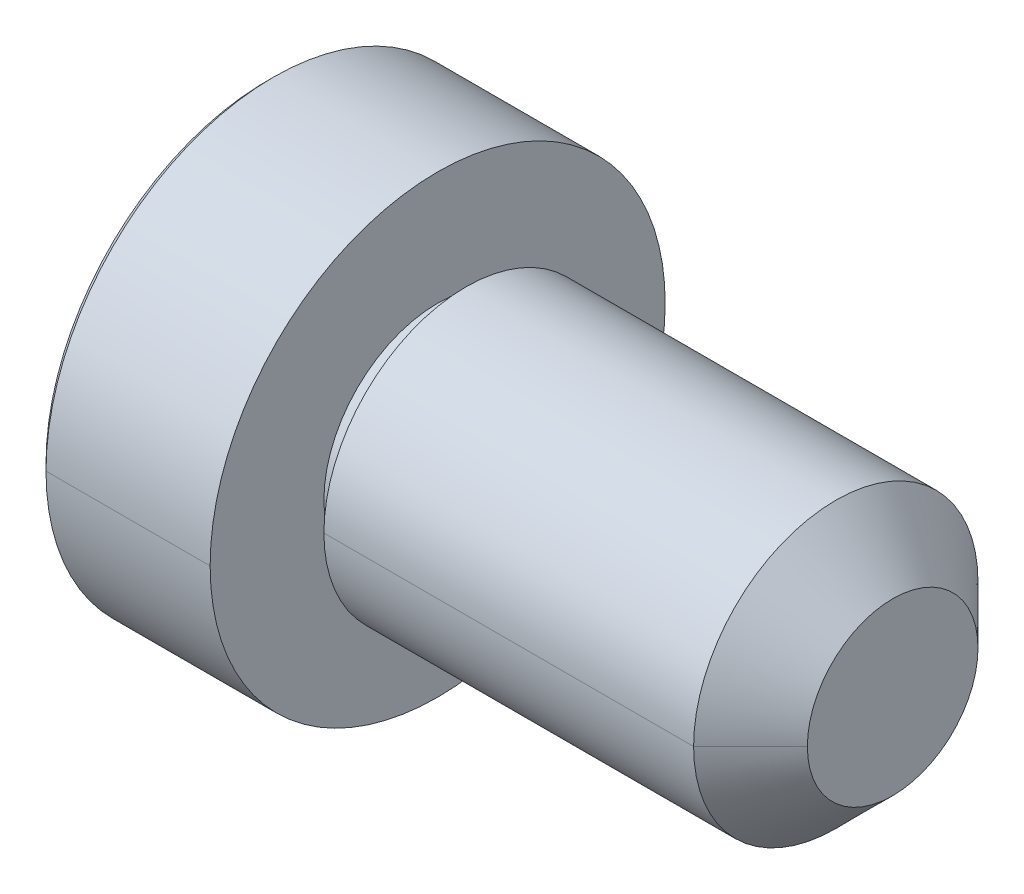
ISO-10303-21;
HEADER;
FILE_DESCRIPTION(('STEP AP214'),'2;1');
FILE_NAME('part.step','',(''),(''),'','','');
FILE_SCHEMA(('AUTOMOTIVE_DESIGN { 1 0 10303 214 1 1 1 1 }'));
ENDSEC;
DATA;
#1=APPLICATION_CONTEXT('core data for automotive mechanical design processes');
#2=APPLICATION_PROTOCOL_DEFINITION('international standard','automotive_design',2000,#1);
#3=PRODUCT_CONTEXT('',#1,'mechanical');
#4=PRODUCT('Part','Part','',(#3));
#5=PRODUCT_RELATED_PRODUCT_CATEGORY('part','',(#4));
#6=PRODUCT_DEFINITION_FORMATION('','',#4);
#7=PRODUCT_DEFINITION_CONTEXT('part definition',#1,'design');
#8=PRODUCT_DEFINITION('design','',#6,#7);
#9=PRODUCT_DEFINITION_SHAPE('','',#8);
#10=(LENGTH_UNIT() NAMED_UNIT(*) SI_UNIT(.MILLI.,.METRE.));
#11=(NAMED_UNIT(*) PLANE_ANGLE_UNIT() SI_UNIT($,.RADIAN.));
#12=(NAMED_UNIT(*) SI_UNIT($,.STERADIAN.) SOLID_ANGLE_UNIT());
#13=UNCERTAINTY_MEASURE_WITH_UNIT(LENGTH_MEASURE(1.E-05),#10,'distance_accuracy_value','');
#14=(GEOMETRIC_REPRESENTATION_CONTEXT(3) GLOBAL_UNCERTAINTY_ASSIGNED_CONTEXT((#13)) GLOBAL_UNIT_ASSIGNED_CONTEXT((#10,
#11,#12)) REPRESENTATION_CONTEXT('',''));
#15=CARTESIAN_POINT('',(0.,0.,0.));
#16=DIRECTION('',(0.,0.,1.));
#17=DIRECTION('',(1.,0.,0.));
#18=AXIS2_PLACEMENT_3D('',#15,#16,#17);
#19=CARTESIAN_POINT('',(7.,0.,0.));
#20=DIRECTION('',(-1.,0.,0.));
#21=DIRECTION('',(0.,-1.,0.));
#22=AXIS2_PLACEMENT_3D('',#19,#20,#21);
#23=CONICAL_SURFACE('',#22,2.5,0.7853981634);
#24=CARTESIAN_POINT('',(8.,0.,0.));
#25=DIRECTION('',(1.,0.,0.));
#26=DIRECTION('',(0.,0.,-1.));
#27=AXIS2_PLACEMENT_3D('',#24,#25,#26);
#28=CIRCLE('',#27,1.5);
#29=CARTESIAN_POINT('',(8.,0.,-1.5));
#30=VERTEX_POINT('',#29);
#31=CARTESIAN_POINT('',(7.99999999999745,0.,1.49999999999745));
#32=VERTEX_POINT('',#31);
#33=EDGE_CURVE('E11',#30,#32,#28,.T.);
#34=ORIENTED_EDGE('',*,*,#33,.F.);
#35=DIRECTION('',(-0.707106781184744,0.,-0.707106781188352));
#36=VECTOR('',#35,1.);
#37=CARTESIAN_POINT('',(7.99999999999745,0.,-1.49999999999745));
#38=LINE('',#37,#36);
#39=CARTESIAN_POINT('',(7.,0.,-2.5));
#40=VERTEX_POINT('',#39);
#41=EDGE_CURVE('E24',#30,#40,#38,.T.);
#42=ORIENTED_EDGE('',*,*,#41,.T.);
#43=CARTESIAN_POINT('',(7.,0.,0.));
#44=DIRECTION('',(1.,0.,0.));
#45=DIRECTION('',(0.,0.,-1.));
#46=AXIS2_PLACEMENT_3D('',#43,#44,#45);
#47=CIRCLE('',#46,2.5);
#48=CARTESIAN_POINT('',(7.,0.,2.5));
#49=VERTEX_POINT('',#48);
#50=EDGE_CURVE('E186',#40,#49,#47,.T.);
#51=ORIENTED_EDGE('',*,*,#50,.T.);
#52=DIRECTION('',(-0.707106781184744,0.,0.707106781188352));
#53=VECTOR('',#52,1.);
#54=CARTESIAN_POINT('',(7.99999999999745,0.,1.49999999999745));
#55=LINE('',#54,#53);
#56=EDGE_CURVE('E181',#32,#49,#55,.T.);
#57=ORIENTED_EDGE('',*,*,#56,.F.);
#58=EDGE_LOOP('',(#34,#42,#51,#57));
#59=FACE_BOUND('',#58,.T.);
#60=ADVANCED_FACE('F16',(#59),#23,.T.);
#61=CARTESIAN_POINT('',(7.,0.,0.));
#62=DIRECTION('',(-1.,0.,0.));
#63=DIRECTION('',(0.,1.,0.));
#64=AXIS2_PLACEMENT_3D('',#61,#62,#63);
#65=CONICAL_SURFACE('',#64,2.5,0.7853981634);
#66=CARTESIAN_POINT('',(7.,0.,0.));
#67=DIRECTION('',(1.,0.,0.));
#68=DIRECTION('',(0.,0.,-1.));
#69=AXIS2_PLACEMENT_3D('',#66,#67,#68);
#70=CIRCLE('',#69,2.5);
#71=EDGE_CURVE('E177',#49,#40,#70,.T.);
#72=ORIENTED_EDGE('',*,*,#71,.T.);
#73=ORIENTED_EDGE('',*,*,#41,.F.);
#74=CARTESIAN_POINT('',(8.,0.,0.));
#75=DIRECTION('',(1.,0.,0.));
#76=DIRECTION('',(0.,0.,-1.));
#77=AXIS2_PLACEMENT_3D('',#74,#75,#76);
#78=CIRCLE('',#77,1.5);
#79=EDGE_CURVE('E172',#32,#30,#78,.T.);
#80=ORIENTED_EDGE('',*,*,#79,.F.);
#81=ORIENTED_EDGE('',*,*,#56,.T.);
#82=EDGE_LOOP('',(#72,#73,#80,#81));
#83=FACE_BOUND('',#82,.T.);
#84=ADVANCED_FACE('F200',(#83),#65,.T.);
#85=CARTESIAN_POINT('',(8.,1.5,0.));
#86=DIRECTION('',(-1.,0.,0.));
#87=DIRECTION('',(0.,0.,1.));
#88=AXIS2_PLACEMENT_3D('',#85,#86,#87);
#89=PLANE('',#88);
#90=ORIENTED_EDGE('',*,*,#33,.T.);
#91=ORIENTED_EDGE('',*,*,#79,.T.);
#92=EDGE_LOOP('',(#90,#91));
#93=FACE_BOUND('',#92,.T.);
#94=ADVANCED_FACE('F248',(#93),#89,.F.);
#95=CARTESIAN_POINT('',(8.,0.,0.));
#96=DIRECTION('',(-1.,0.,0.));
#97=DIRECTION('',(0.,1.,0.));
#98=AXIS2_PLACEMENT_3D('',#95,#96,#97);
#99=CYLINDRICAL_SURFACE('',#98,2.5);
#100=CARTESIAN_POINT('',(0.5,0.,0.));
#101=DIRECTION('',(1.,0.,0.));
#102=DIRECTION('',(0.,0.,-1.));
#103=AXIS2_PLACEMENT_3D('',#100,#101,#102);
#104=CIRCLE('',#103,2.5);
#105=CARTESIAN_POINT('',(0.5,0.,2.5));
#106=VERTEX_POINT('',#105);
#107=CARTESIAN_POINT('',(0.5,0.,-2.5));
#108=VERTEX_POINT('',#107);
#109=EDGE_CURVE('E168',#106,#108,#104,.T.);
#110=ORIENTED_EDGE('',*,*,#109,.T.);
#111=DIRECTION('',(-1.,0.,0.));
#112=VECTOR('',#111,1.);
#113=CARTESIAN_POINT('',(7.,0.,-2.5));
#114=LINE('',#113,#112);
#115=EDGE_CURVE('E163',#40,#108,#114,.T.);
#116=ORIENTED_EDGE('',*,*,#115,.F.);
#117=ORIENTED_EDGE('',*,*,#71,.F.);
#118=DIRECTION('',(-1.,0.,0.));
#119=VECTOR('',#118,1.);
#120=CARTESIAN_POINT('',(7.,0.,2.5));
#121=LINE('',#120,#119);
#122=EDGE_CURVE('E159',#49,#106,#121,.T.);
#123=ORIENTED_EDGE('',*,*,#122,.T.);
#124=EDGE_LOOP('',(#110,#116,#117,#123));
#125=FACE_BOUND('',#124,.T.);
#126=ADVANCED_FACE('F203',(#125),#99,.T.);
#127=CARTESIAN_POINT('',(8.,0.,0.));
#128=DIRECTION('',(-1.,0.,0.));
#129=DIRECTION('',(0.,-1.,0.));
#130=AXIS2_PLACEMENT_3D('',#127,#128,#129);
#131=CYLINDRICAL_SURFACE('',#130,2.5);
#132=ORIENTED_EDGE('',*,*,#50,.F.);
#133=ORIENTED_EDGE('',*,*,#115,.T.);
#134=CARTESIAN_POINT('',(0.5,0.,0.));
#135=DIRECTION('',(1.,0.,0.));
#136=DIRECTION('',(0.,0.,-1.));
#137=AXIS2_PLACEMENT_3D('',#134,#135,#136);
#138=CIRCLE('',#137,2.5);
#139=EDGE_CURVE('E154',#108,#106,#138,.T.);
#140=ORIENTED_EDGE('',*,*,#139,.T.);
#141=ORIENTED_EDGE('',*,*,#122,.F.);
#142=EDGE_LOOP('',(#132,#133,#140,#141));
#143=FACE_BOUND('',#142,.T.);
#144=ADVANCED_FACE('F204',(#143),#131,.T.);
#145=CARTESIAN_POINT('',(0.5,2.,0.));
#146=DIRECTION('',(1.,0.,0.));
#147=DIRECTION('',(0.,0.,-1.));
#148=AXIS2_PLACEMENT_3D('',#145,#146,#147);
#149=PLANE('',#148);
#150=ORIENTED_EDGE('',*,*,#139,.F.);
#151=ORIENTED_EDGE('',*,*,#109,.F.);
#152=EDGE_LOOP('',(#150,#151));
#153=FACE_BOUND('',#152,.T.);
#154=CARTESIAN_POINT('',(0.5,0.,0.));
#155=DIRECTION('',(1.,0.,0.));
#156=DIRECTION('',(0.,0.,-1.));
#157=AXIS2_PLACEMENT_3D('',#154,#155,#156);
#158=CIRCLE('',#157,2.);
#159=CARTESIAN_POINT('',(0.5,0.,-2.));
#160=VERTEX_POINT('',#159);
#161=CARTESIAN_POINT('',(0.5,0.,2.));
#162=VERTEX_POINT('',#161);
#163=EDGE_CURVE('E150',#160,#162,#158,.T.);
#164=ORIENTED_EDGE('',*,*,#163,.T.);
#165=CARTESIAN_POINT('',(0.5,0.,0.));
#166=DIRECTION('',(1.,0.,0.));
#167=DIRECTION('',(0.,0.,-1.));
#168=AXIS2_PLACEMENT_3D('',#165,#166,#167);
#169=CIRCLE('',#168,2.);
#170=EDGE_CURVE('E146',#162,#160,#169,.T.);
#171=ORIENTED_EDGE('',*,*,#170,.T.);
#172=EDGE_LOOP('',(#164,#171));
#173=FACE_BOUND('',#172,.T.);
#174=ADVANCED_FACE('F208',(#153,#173),#149,.F.);
#175=CARTESIAN_POINT('',(8.,0.,0.));
#176=DIRECTION('',(-1.,0.,0.));
#177=DIRECTION('',(0.,1.,0.));
#178=AXIS2_PLACEMENT_3D('',#175,#176,#177);
#179=CYLINDRICAL_SURFACE('',#178,2.);
#180=CARTESIAN_POINT('',(0.,0.,0.));
#181=DIRECTION('',(1.,0.,0.));
#182=DIRECTION('',(0.,0.,-1.));
#183=AXIS2_PLACEMENT_3D('',#180,#181,#182);
#184=CIRCLE('',#183,2.);
#185=CARTESIAN_POINT('',(0.,0.,2.));
#186=VERTEX_POINT('',#185);
#187=CARTESIAN_POINT('',(0.,0.,-2.));
#188=VERTEX_POINT('',#187);
#189=EDGE_CURVE('E142',#186,#188,#184,.T.);
#190=ORIENTED_EDGE('',*,*,#189,.T.);
#191=DIRECTION('',(-1.,0.,0.));
#192=VECTOR('',#191,1.);
#193=CARTESIAN_POINT('',(0.5,0.,-2.));
#194=LINE('',#193,#192);
#195=EDGE_CURVE('E137',#160,#188,#194,.T.);
#196=ORIENTED_EDGE('',*,*,#195,.F.);
#197=ORIENTED_EDGE('',*,*,#170,.F.);
#198=DIRECTION('',(-1.,0.,0.));
#199=VECTOR('',#198,1.);
#200=CARTESIAN_POINT('',(0.5,0.,2.));
#201=LINE('',#200,#199);
#202=EDGE_CURVE('E133',#162,#186,#201,.T.);
#203=ORIENTED_EDGE('',*,*,#202,.T.);
#204=EDGE_LOOP('',(#190,#196,#197,#203));
#205=FACE_BOUND('',#204,.T.);
#206=ADVANCED_FACE('F211',(#205),#179,.T.);
#207=CARTESIAN_POINT('',(8.,0.,0.));
#208=DIRECTION('',(-1.,0.,0.));
#209=DIRECTION('',(0.,-1.,0.));
#210=AXIS2_PLACEMENT_3D('',#207,#208,#209);
#211=CYLINDRICAL_SURFACE('',#210,2.);
#212=ORIENTED_EDGE('',*,*,#163,.F.);
#213=ORIENTED_EDGE('',*,*,#195,.T.);
#214=CARTESIAN_POINT('',(0.,0.,0.));
#215=DIRECTION('',(1.,0.,0.));
#216=DIRECTION('',(0.,0.,-1.));
#217=AXIS2_PLACEMENT_3D('',#214,#215,#216);
#218=CIRCLE('',#217,2.);
#219=EDGE_CURVE('E128',#188,#186,#218,.T.);
#220=ORIENTED_EDGE('',*,*,#219,.T.);
#221=ORIENTED_EDGE('',*,*,#202,.F.);
#222=EDGE_LOOP('',(#212,#213,#220,#221));
#223=FACE_BOUND('',#222,.T.);
#224=ADVANCED_FACE('F219',(#223),#211,.T.);
#225=CARTESIAN_POINT('',(0.,4.,0.));
#226=DIRECTION('',(-1.,0.,0.));
#227=DIRECTION('',(0.,0.,1.));
#228=AXIS2_PLACEMENT_3D('',#225,#226,#227);
#229=PLANE('',#228);
#230=ORIENTED_EDGE('',*,*,#219,.F.);
#231=ORIENTED_EDGE('',*,*,#189,.F.);
#232=EDGE_LOOP('',(#230,#231));
#233=FACE_BOUND('',#232,.T.);
#234=CARTESIAN_POINT('',(0.,0.,0.));
#235=DIRECTION('',(1.,0.,0.));
#236=DIRECTION('',(0.,0.,-1.));
#237=AXIS2_PLACEMENT_3D('',#234,#235,#236);
#238=CIRCLE('',#237,4.);
#239=CARTESIAN_POINT('',(0.,0.,-4.));
#240=VERTEX_POINT('',#239);
#241=CARTESIAN_POINT('',(0.,0.,4.));
#242=VERTEX_POINT('',#241);
#243=EDGE_CURVE('E124',#240,#242,#238,.T.);
#244=ORIENTED_EDGE('',*,*,#243,.T.);
#245=CARTESIAN_POINT('',(0.,0.,0.));
#246=DIRECTION('',(1.,0.,0.));
#247=DIRECTION('',(0.,0.,-1.));
#248=AXIS2_PLACEMENT_3D('',#245,#246,#247);
#249=CIRCLE('',#248,4.);
#250=EDGE_CURVE('E120',#242,#240,#249,.T.);
#251=ORIENTED_EDGE('',*,*,#250,.T.);
#252=EDGE_LOOP('',(#244,#251));
#253=FACE_BOUND('',#252,.T.);
#254=ADVANCED_FACE('F223',(#233,#253),#229,.F.);
#255=CARTESIAN_POINT('',(8.,0.,0.));
#256=DIRECTION('',(-1.,0.,0.));
#257=DIRECTION('',(0.,1.,0.));
#258=AXIS2_PLACEMENT_3D('',#255,#256,#257);
#259=CYLINDRICAL_SURFACE('',#258,4.);
#260=CARTESIAN_POINT('',(-2.8857142857143,0.,0.));
#261=DIRECTION('',(1.,0.,0.));
#262=DIRECTION('',(0.,0.,-1.));
#263=AXIS2_PLACEMENT_3D('',#260,#261,#262);
#264=CIRCLE('',#263,4.);
#265=CARTESIAN_POINT('',(-2.8857142857143,0.,4.));
#266=VERTEX_POINT('',#265);
#267=CARTESIAN_POINT('',(-2.8857142857143,0.,-4.));
#268=VERTEX_POINT('',#267);
#269=EDGE_CURVE('E91',#266,#268,#264,.T.);
#270=ORIENTED_EDGE('',*,*,#269,.T.);
#271=DIRECTION('',(-1.,0.,0.));
#272=VECTOR('',#271,1.);
#273=CARTESIAN_POINT('',(0.,0.,-4.));
#274=LINE('',#273,#272);
#275=EDGE_CURVE('E112',#240,#268,#274,.T.);
#276=ORIENTED_EDGE('',*,*,#275,.F.);
#277=ORIENTED_EDGE('',*,*,#250,.F.);
#278=DIRECTION('',(-1.,0.,0.));
#279=VECTOR('',#278,1.);
#280=CARTESIAN_POINT('',(0.,0.,4.));
#281=LINE('',#280,#279);
#282=EDGE_CURVE('E108',#242,#266,#281,.T.);
#283=ORIENTED_EDGE('',*,*,#282,.T.);
#284=EDGE_LOOP('',(#270,#276,#277,#283));
#285=FACE_BOUND('',#284,.T.);
#286=ADVANCED_FACE('F226',(#285),#259,.T.);
#287=CARTESIAN_POINT('',(8.,0.,0.));
#288=DIRECTION('',(-1.,0.,0.));
#289=DIRECTION('',(0.,-1.,0.));
#290=AXIS2_PLACEMENT_3D('',#287,#288,#289);
#291=CYLINDRICAL_SURFACE('',#290,4.);
#292=ORIENTED_EDGE('',*,*,#243,.F.);
#293=ORIENTED_EDGE('',*,*,#275,.T.);
#294=CARTESIAN_POINT('',(-2.8857142857143,0.,0.));
#295=DIRECTION('',(1.,0.,0.));
#296=DIRECTION('',(0.,0.,-1.));
#297=AXIS2_PLACEMENT_3D('',#294,#295,#296);
#298=CIRCLE('',#297,4.);
#299=EDGE_CURVE('E103',#268,#266,#298,.T.);
#300=ORIENTED_EDGE('',*,*,#299,.T.);
#301=ORIENTED_EDGE('',*,*,#282,.F.);
#302=EDGE_LOOP('',(#292,#293,#300,#301));
#303=FACE_BOUND('',#302,.T.);
#304=ADVANCED_FACE('F234',(#303),#291,.T.);
#305=CARTESIAN_POINT('',(-3.,0.,0.));
#306=DIRECTION('',(1.,0.,0.));
#307=DIRECTION('',(0.,-1.,0.));
#308=AXIS2_PLACEMENT_3D('',#305,#306,#307);
#309=CONICAL_SURFACE('',#308,3.8857142857,0.7853981634);
#310=ORIENTED_EDGE('',*,*,#299,.F.);
#311=DIRECTION('',(0.707106781184742,0.,-0.707106781188353));
#312=VECTOR('',#311,1.);
#313=CARTESIAN_POINT('',(-3.,0.,-3.8857142857));
#314=LINE('',#313,#312);
#315=CARTESIAN_POINT('',(-3.,0.,-3.8857142857143));
#316=VERTEX_POINT('',#315);
#317=EDGE_CURVE('E83',#316,#268,#314,.T.);
#318=ORIENTED_EDGE('',*,*,#317,.F.);
#319=CARTESIAN_POINT('',(-3.,0.,0.));
#320=DIRECTION('',(1.,0.,0.));
#321=DIRECTION('',(0.,0.,-1.));
#322=AXIS2_PLACEMENT_3D('',#319,#320,#321);
#323=CIRCLE('',#322,3.8857142857);
#324=CARTESIAN_POINT('',(-3.,0.,3.8857142857));
#325=VERTEX_POINT('',#324);
#326=EDGE_CURVE('E76',#316,#325,#323,.T.);
#327=ORIENTED_EDGE('',*,*,#326,.T.);
#328=DIRECTION('',(0.707106781184742,0.,0.707106781188353));
#329=VECTOR('',#328,1.);
#330=CARTESIAN_POINT('',(-3.,0.,3.8857142857));
#331=LINE('',#330,#329);
#332=EDGE_CURVE('E80',#325,#266,#331,.T.);
#333=ORIENTED_EDGE('',*,*,#332,.T.);
#334=EDGE_LOOP('',(#310,#318,#327,#333));
#335=FACE_BOUND('',#334,.T.);
#336=ADVANCED_FACE('F79',(#335),#309,.T.);
#337=CARTESIAN_POINT('',(-3.,0.,0.));
#338=DIRECTION('',(1.,0.,0.));
#339=DIRECTION('',(0.,1.,0.));
#340=AXIS2_PLACEMENT_3D('',#337,#338,#339);
#341=CONICAL_SURFACE('',#340,3.8857142857,0.7853981634);
#342=CARTESIAN_POINT('',(-3.,0.,0.));
#343=DIRECTION('',(1.,0.,0.));
#344=DIRECTION('',(0.,0.,-1.));
#345=AXIS2_PLACEMENT_3D('',#342,#343,#344);
#346=CIRCLE('',#345,3.8857142857);
#347=EDGE_CURVE('E90',#325,#316,#346,.T.);
#348=ORIENTED_EDGE('',*,*,#347,.T.);
#349=ORIENTED_EDGE('',*,*,#317,.T.);
#350=ORIENTED_EDGE('',*,*,#269,.F.);
#351=ORIENTED_EDGE('',*,*,#332,.F.);
#352=EDGE_LOOP('',(#348,#349,#350,#351));
#353=FACE_BOUND('',#352,.T.);
#354=ADVANCED_FACE('F89',(#353),#341,.T.);
#355=CARTESIAN_POINT('',(-3.,0.,0.));
#356=DIRECTION('',(1.,0.,0.));
#357=DIRECTION('',(0.,0.,-1.));
#358=AXIS2_PLACEMENT_3D('',#355,#356,#357);
#359=PLANE('',#358);
#360=ORIENTED_EDGE('',*,*,#326,.F.);
#361=ORIENTED_EDGE('',*,*,#347,.F.);
#362=EDGE_LOOP('',(#360,#361));
#363=FACE_BOUND('',#362,.T.);
#364=ADVANCED_FACE('F93',(#363),#359,.F.);
#365=CLOSED_SHELL('',(#60,#84,#94,#126,#144,#174,#206,#224,#254,#286,#304,#336,#354,#364));
#366=MANIFOLD_SOLID_BREP('B1',#365);
#367=ADVANCED_BREP_SHAPE_REPRESENTATION('',(#18,#366),#14);
#368=SHAPE_DEFINITION_REPRESENTATION(#9,#367);
ENDSEC;
END-ISO-10303-21;
